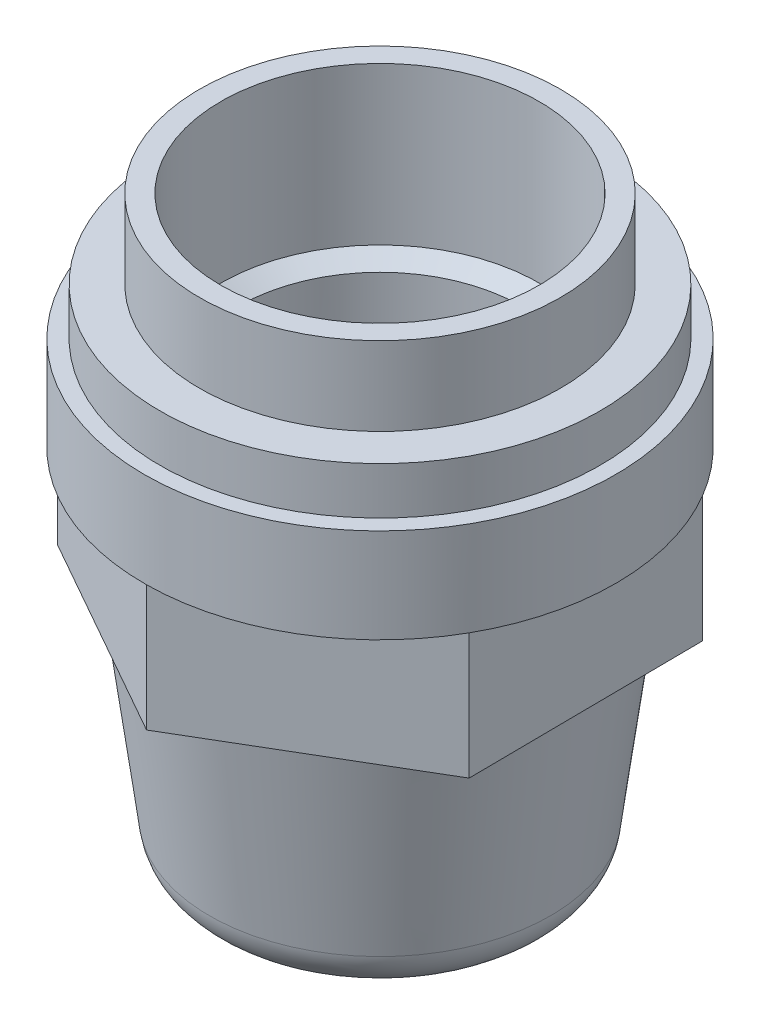
ISO-10303-21;
HEADER;
FILE_DESCRIPTION(('STEP AP214'),'2;1');
FILE_NAME('part.step','',(''),(''),'','','');
FILE_SCHEMA(('AUTOMOTIVE_DESIGN { 1 0 10303 214 1 1 1 1 }'));
ENDSEC;
DATA;
#1=APPLICATION_CONTEXT('core data for automotive mechanical design processes');
#2=APPLICATION_PROTOCOL_DEFINITION('international standard','automotive_design',2000,#1);
#3=PRODUCT_CONTEXT('',#1,'mechanical');
#4=PRODUCT('Part','Part','',(#3));
#5=PRODUCT_RELATED_PRODUCT_CATEGORY('part','',(#4));
#6=PRODUCT_DEFINITION_FORMATION('','',#4);
#7=PRODUCT_DEFINITION_CONTEXT('part definition',#1,'design');
#8=PRODUCT_DEFINITION('design','',#6,#7);
#9=PRODUCT_DEFINITION_SHAPE('','',#8);
#10=(LENGTH_UNIT() NAMED_UNIT(*) SI_UNIT(.MILLI.,.METRE.));
#11=(NAMED_UNIT(*) PLANE_ANGLE_UNIT() SI_UNIT($,.RADIAN.));
#12=(NAMED_UNIT(*) SI_UNIT($,.STERADIAN.) SOLID_ANGLE_UNIT());
#13=UNCERTAINTY_MEASURE_WITH_UNIT(LENGTH_MEASURE(1.E-05),#10,'distance_accuracy_value','');
#14=(GEOMETRIC_REPRESENTATION_CONTEXT(3) GLOBAL_UNCERTAINTY_ASSIGNED_CONTEXT((#13)) GLOBAL_UNIT_ASSIGNED_CONTEXT((#10,
#11,#12)) REPRESENTATION_CONTEXT('',''));
#15=CARTESIAN_POINT('',(0.,0.,0.));
#16=DIRECTION('',(0.,0.,1.));
#17=DIRECTION('',(1.,0.,0.));
#18=AXIS2_PLACEMENT_3D('',#15,#16,#17);
#19=CARTESIAN_POINT('',(0.,0.,0.));
#20=DIRECTION('',(0.,-1.,0.));
#21=DIRECTION('',(0.,0.,-1.));
#22=AXIS2_PLACEMENT_3D('',#19,#20,#21);
#23=CYLINDRICAL_SURFACE('',#22,8.97478397273857);
#24=CARTESIAN_POINT('',(0.,26.4239555504727,0.));
#25=DIRECTION('',(0.,1.,0.));
#26=DIRECTION('',(0.,0.,1.));
#27=AXIS2_PLACEMENT_3D('',#24,#25,#26);
#28=CIRCLE('',#27,8.97478397273857);
#29=CARTESIAN_POINT('',(0.,26.4239555504727,8.97478397273857));
#30=VERTEX_POINT('',#29);
#31=EDGE_CURVE('E43',#30,#30,#28,.T.);
#32=ORIENTED_EDGE('',*,*,#31,.T.);
#33=EDGE_LOOP('',(#32));
#34=FACE_BOUND('',#33,.T.);
#35=CARTESIAN_POINT('',(0.,23.1150750646285,0.));
#36=DIRECTION('',(0.,-1.,0.));
#37=DIRECTION('',(0.,0.,-1.));
#38=AXIS2_PLACEMENT_3D('',#35,#36,#37);
#39=CIRCLE('',#38,8.97478397273857);
#40=CARTESIAN_POINT('',(0.,23.1150750646285,-8.97478397273857));
#41=VERTEX_POINT('',#40);
#42=EDGE_CURVE('E159',#41,#41,#39,.T.);
#43=ORIENTED_EDGE('',*,*,#42,.T.);
#44=EDGE_LOOP('',(#43));
#45=FACE_BOUND('',#44,.T.);
#46=ADVANCED_FACE('F39',(#34,#45),#23,.F.);
#47=CARTESIAN_POINT('',(-12.4716213756877,23.1150750646285,0.));
#48=DIRECTION('',(0.,1.,0.));
#49=DIRECTION('',(0.,0.,1.));
#50=AXIS2_PLACEMENT_3D('',#47,#48,#49);
#51=PLANE('',#50);
#52=DIRECTION('',(0.00909857298194774,0.,0.999958607128161));
#53=VECTOR('',#52,1.);
#54=CARTESIAN_POINT('',(12.9085824864457,23.1150750646285,-7.61020666920113));
#55=LINE('',#54,#53);
#56=CARTESIAN_POINT('',(12.9085824864457,23.1150750646285,-7.61020666920113));
#57=VERTEX_POINT('',#56);
#58=CARTESIAN_POINT('',(13.0449235468008,23.1150750646285,7.37405702550828));
#59=VERTEX_POINT('',#58);
#60=EDGE_CURVE('E123',#57,#59,#55,.T.);
#61=ORIENTED_EDGE('',*,*,#60,.F.);
#62=CARTESIAN_POINT('',(0.,23.1150750646285,0.));
#63=DIRECTION('',(0.,-1.,0.));
#64=DIRECTION('',(0.,0.,-1.));
#65=AXIS2_PLACEMENT_3D('',#62,#63,#64);
#66=CIRCLE('',#65,14.9848839620908);
#67=EDGE_CURVE('E184',#57,#59,#66,.T.);
#68=ORIENTED_EDGE('',*,*,#67,.T.);
#69=EDGE_LOOP('',(#61,#68));
#70=FACE_BOUND('',#69,.T.);
#71=ADVANCED_FACE('F289',(#70),#51,.F.);
#72=DIRECTION('',(-0.861440270014917,0.,0.507858898904634));
#73=VECTOR('',#72,1.);
#74=CARTESIAN_POINT('',(13.0449235468008,23.1150750646285,7.37405702550828));
#75=LINE('',#74,#73);
#76=CARTESIAN_POINT('',(0.136341060355105,23.1150750646285,14.9842636947094));
#77=VERTEX_POINT('',#76);
#78=EDGE_CURVE('E217',#59,#77,#75,.T.);
#79=ORIENTED_EDGE('',*,*,#78,.F.);
#80=EDGE_CURVE('E189',#59,#77,#66,.T.);
#81=ORIENTED_EDGE('',*,*,#80,.T.);
#82=EDGE_LOOP('',(#79,#81));
#83=FACE_BOUND('',#82,.T.);
#84=ADVANCED_FACE('F281',(#83),#51,.F.);
#85=DIRECTION('',(-0.870538842996865,0.,-0.492099708223527));
#86=VECTOR('',#85,1.);
#87=CARTESIAN_POINT('',(0.136341060355095,23.1150750646285,14.9842636947094));
#88=LINE('',#87,#86);
#89=CARTESIAN_POINT('',(-12.9085824864457,23.1150750646285,7.61020666920113));
#90=VERTEX_POINT('',#89);
#91=EDGE_CURVE('E237',#77,#90,#88,.T.);
#92=ORIENTED_EDGE('',*,*,#91,.F.);
#93=EDGE_CURVE('E271',#77,#90,#66,.T.);
#94=ORIENTED_EDGE('',*,*,#93,.T.);
#95=EDGE_LOOP('',(#92,#94));
#96=FACE_BOUND('',#95,.T.);
#97=ADVANCED_FACE('F270',(#96),#51,.F.);
#98=DIRECTION('',(-0.00909857298194774,0.,-0.999958607128161));
#99=VECTOR('',#98,1.);
#100=CARTESIAN_POINT('',(-12.9085824864457,23.1150750646285,7.61020666920113));
#101=LINE('',#100,#99);
#102=CARTESIAN_POINT('',(-13.0449235468008,23.1150750646285,-7.37405702550826));
#103=VERTEX_POINT('',#102);
#104=EDGE_CURVE('E241',#90,#103,#101,.T.);
#105=ORIENTED_EDGE('',*,*,#104,.F.);
#106=EDGE_CURVE('E278',#90,#103,#66,.T.);
#107=ORIENTED_EDGE('',*,*,#106,.T.);
#108=EDGE_LOOP('',(#105,#107));
#109=FACE_BOUND('',#108,.T.);
#110=ADVANCED_FACE('F507',(#109),#51,.F.);
#111=DIRECTION('',(0.861440270014917,0.,-0.507858898904634));
#112=VECTOR('',#111,1.);
#113=CARTESIAN_POINT('',(-13.0449235468008,23.1150750646285,-7.37405702550827));
#114=LINE('',#113,#112);
#115=CARTESIAN_POINT('',(-0.13634106035509,23.1150750646285,-14.9842636947094));
#116=VERTEX_POINT('',#115);
#117=EDGE_CURVE('E62',#103,#116,#114,.T.);
#118=ORIENTED_EDGE('',*,*,#117,.F.);
#119=EDGE_CURVE('E285',#103,#116,#66,.T.);
#120=ORIENTED_EDGE('',*,*,#119,.T.);
#121=EDGE_LOOP('',(#118,#120));
#122=FACE_BOUND('',#121,.T.);
#123=ADVANCED_FACE('F349',(#122),#51,.F.);
#124=DIRECTION('',(0.870538842996865,0.,0.492099708223527));
#125=VECTOR('',#124,1.);
#126=CARTESIAN_POINT('',(-0.136341060355103,23.1150750646285,-14.9842636947094));
#127=LINE('',#126,#125);
#128=EDGE_CURVE('E55',#116,#57,#127,.T.);
#129=ORIENTED_EDGE('',*,*,#128,.F.);
#130=EDGE_CURVE('E183',#116,#57,#66,.T.);
#131=ORIENTED_EDGE('',*,*,#130,.T.);
#132=EDGE_LOOP('',(#129,#131));
#133=FACE_BOUND('',#132,.T.);
#134=ADVANCED_FACE('F287',(#133),#51,.F.);
#135=CARTESIAN_POINT('',(0.,0.130191102537697,0.));
#136=DIRECTION('',(0.,-1.,0.));
#137=DIRECTION('',(0.,0.,-1.));
#138=AXIS2_PLACEMENT_3D('',#135,#136,#137);
#139=CONICAL_SURFACE('',#138,4.5,0.00281604693828828);
#140=CARTESIAN_POINT('',(0.,2.48056138832506,0.));
#141=DIRECTION('',(0.,-1.,0.));
#142=DIRECTION('',(0.,0.,-1.));
#143=AXIS2_PLACEMENT_3D('',#140,#141,#142);
#144=CIRCLE('',#143,4.49338122945697);
#145=CARTESIAN_POINT('',(0.,2.48056138832506,-4.49338122945697));
#146=VERTEX_POINT('',#145);
#147=EDGE_CURVE('E125',#146,#146,#144,.T.);
#148=ORIENTED_EDGE('',*,*,#147,.F.);
#149=EDGE_LOOP('',(#148));
#150=FACE_BOUND('',#149,.T.);
#151=CARTESIAN_POINT('',(0.,0.130191102537697,0.));
#152=DIRECTION('',(0.,-1.,0.));
#153=DIRECTION('',(0.,0.,-1.));
#154=AXIS2_PLACEMENT_3D('',#151,#152,#153);
#155=CIRCLE('',#154,4.5);
#156=CARTESIAN_POINT('',(0.,0.130191102537697,-4.5));
#157=VERTEX_POINT('',#156);
#158=EDGE_CURVE('E11',#157,#157,#155,.T.);
#159=ORIENTED_EDGE('',*,*,#158,.T.);
#160=EDGE_LOOP('',(#159));
#161=FACE_BOUND('',#160,.T.);
#162=ADVANCED_FACE('F41',(#150,#161),#139,.F.);
#163=CARTESIAN_POINT('',(-4.5,0.130191102537697,0.));
#164=DIRECTION('',(0.,1.,0.));
#165=DIRECTION('',(0.,0.,1.));
#166=AXIS2_PLACEMENT_3D('',#163,#164,#165);
#167=PLANE('',#166);
#168=ORIENTED_EDGE('',*,*,#158,.F.);
#169=EDGE_LOOP('',(#168));
#170=FACE_BOUND('',#169,.T.);
#171=CARTESIAN_POINT('',(0.,0.130191102537697,0.));
#172=DIRECTION('',(0.,-1.,0.));
#173=DIRECTION('',(0.,0.,-1.));
#174=AXIS2_PLACEMENT_3D('',#171,#172,#173);
#175=CIRCLE('',#174,7.86886589131418);
#176=CARTESIAN_POINT('',(0.,0.130191102537697,-7.86886589131418));
#177=VERTEX_POINT('',#176);
#178=EDGE_CURVE('E49',#177,#177,#175,.T.);
#179=ORIENTED_EDGE('',*,*,#178,.T.);
#180=EDGE_LOOP('',(#179));
#181=FACE_BOUND('',#180,.T.);
#182=ADVANCED_FACE('F197',(#170,#181),#167,.F.);
#183=CARTESIAN_POINT('',(0.,3.1301911025377,0.));
#184=DIRECTION('',(0.,-1.,0.));
#185=DIRECTION('',(0.,0.,-1.));
#186=AXIS2_PLACEMENT_3D('',#183,#184,#185);
#187=TOROIDAL_SURFACE('',#186,7.8688658913142,3.);
#188=ORIENTED_EDGE('',*,*,#178,.F.);
#189=EDGE_LOOP('',(#188));
#190=FACE_BOUND('',#189,.T.);
#191=CARTESIAN_POINT('',(0.,2.73884198026211,0.));
#192=DIRECTION('',(0.,-1.,0.));
#193=DIRECTION('',(0.,0.,-1.));
#194=AXIS2_PLACEMENT_3D('',#191,#192,#193);
#195=CIRCLE('',#194,10.8432306746745);
#196=CARTESIAN_POINT('',(0.,2.73884198026211,-10.8432306746745));
#197=VERTEX_POINT('',#196);
#198=EDGE_CURVE('E188',#197,#197,#195,.T.);
#199=ORIENTED_EDGE('',*,*,#198,.T.);
#200=EDGE_LOOP('',(#199));
#201=FACE_BOUND('',#200,.T.);
#202=ADVANCED_FACE('F199',(#190,#201),#187,.T.);
#203=CARTESIAN_POINT('',(0.,15.1150750646285,0.));
#204=DIRECTION('',(0.,1.,0.));
#205=DIRECTION('',(0.,0.,1.));
#206=AXIS2_PLACEMENT_3D('',#203,#204,#205);
#207=CONICAL_SURFACE('',#206,12.4716213756877,0.130822549512117);
#208=ORIENTED_EDGE('',*,*,#198,.F.);
#209=EDGE_LOOP('',(#208));
#210=FACE_BOUND('',#209,.T.);
#211=CARTESIAN_POINT('',(0.,15.1150750646285,0.));
#212=DIRECTION('',(0.,-1.,0.));
#213=DIRECTION('',(0.,0.,-1.));
#214=AXIS2_PLACEMENT_3D('',#211,#212,#213);
#215=CIRCLE('',#214,12.4716213756877);
#216=CARTESIAN_POINT('',(0.,15.1150750646285,-12.4716213756877));
#217=VERTEX_POINT('',#216);
#218=EDGE_CURVE('E212',#217,#217,#215,.T.);
#219=ORIENTED_EDGE('',*,*,#218,.T.);
#220=EDGE_LOOP('',(#219));
#221=FACE_BOUND('',#220,.T.);
#222=ADVANCED_FACE('F202',(#210,#221),#207,.T.);
#223=CARTESIAN_POINT('',(0.,0.,0.));
#224=DIRECTION('',(0.,-1.,0.));
#225=DIRECTION('',(0.,0.,-1.));
#226=AXIS2_PLACEMENT_3D('',#223,#224,#225);
#227=CYLINDRICAL_SURFACE('',#226,14.9848839620908);
#228=ORIENTED_EDGE('',*,*,#67,.F.);
#229=ORIENTED_EDGE('',*,*,#130,.F.);
#230=ORIENTED_EDGE('',*,*,#119,.F.);
#231=ORIENTED_EDGE('',*,*,#106,.F.);
#232=ORIENTED_EDGE('',*,*,#93,.F.);
#233=ORIENTED_EDGE('',*,*,#80,.F.);
#234=EDGE_LOOP('',(#228,#229,#230,#231,#232,#233));
#235=FACE_BOUND('',#234,.T.);
#236=CARTESIAN_POINT('',(0.,29.1150750646285,0.));
#237=DIRECTION('',(0.,-1.,0.));
#238=DIRECTION('',(0.,0.,-1.));
#239=AXIS2_PLACEMENT_3D('',#236,#237,#238);
#240=CIRCLE('',#239,14.9848839620908);
#241=CARTESIAN_POINT('',(0.,29.1150750646285,-14.9848839620908));
#242=VERTEX_POINT('',#241);
#243=EDGE_CURVE('E179',#242,#242,#240,.T.);
#244=ORIENTED_EDGE('',*,*,#243,.T.);
#245=EDGE_LOOP('',(#244));
#246=FACE_BOUND('',#245,.T.);
#247=ADVANCED_FACE('F208',(#235,#246),#227,.T.);
#248=CARTESIAN_POINT('',(-14.9848839620908,29.1150750646285,0.));
#249=DIRECTION('',(0.,-1.,0.));
#250=DIRECTION('',(0.,0.,-1.));
#251=AXIS2_PLACEMENT_3D('',#248,#249,#250);
#252=PLANE('',#251);
#253=ORIENTED_EDGE('',*,*,#243,.F.);
#254=EDGE_LOOP('',(#253));
#255=FACE_BOUND('',#254,.T.);
#256=CARTESIAN_POINT('',(0.,29.1150750646285,0.));
#257=DIRECTION('',(0.,-1.,0.));
#258=DIRECTION('',(0.,0.,-1.));
#259=AXIS2_PLACEMENT_3D('',#256,#257,#258);
#260=CIRCLE('',#259,13.9838030362747);
#261=CARTESIAN_POINT('',(0.,29.1150750646285,-13.9838030362747));
#262=VERTEX_POINT('',#261);
#263=EDGE_CURVE('E175',#262,#262,#260,.T.);
#264=ORIENTED_EDGE('',*,*,#263,.T.);
#265=EDGE_LOOP('',(#264));
#266=FACE_BOUND('',#265,.T.);
#267=ADVANCED_FACE('F332',(#255,#266),#252,.F.);
#268=CARTESIAN_POINT('',(0.,0.,0.));
#269=DIRECTION('',(0.,-1.,0.));
#270=DIRECTION('',(0.,0.,-1.));
#271=AXIS2_PLACEMENT_3D('',#268,#269,#270);
#272=CYLINDRICAL_SURFACE('',#271,13.9838030362747);
#273=ORIENTED_EDGE('',*,*,#263,.F.);
#274=EDGE_LOOP('',(#273));
#275=FACE_BOUND('',#274,.T.);
#276=CARTESIAN_POINT('',(0.,32.1150750646285,0.));
#277=DIRECTION('',(0.,-1.,0.));
#278=DIRECTION('',(0.,0.,-1.));
#279=AXIS2_PLACEMENT_3D('',#276,#277,#278);
#280=CIRCLE('',#279,13.9838030362747);
#281=CARTESIAN_POINT('',(0.,32.1150750646285,-13.9838030362747));
#282=VERTEX_POINT('',#281);
#283=EDGE_CURVE('E171',#282,#282,#280,.T.);
#284=ORIENTED_EDGE('',*,*,#283,.T.);
#285=EDGE_LOOP('',(#284));
#286=FACE_BOUND('',#285,.T.);
#287=ADVANCED_FACE('F328',(#275,#286),#272,.T.);
#288=CARTESIAN_POINT('',(-13.9838030362747,32.1150750646285,0.));
#289=DIRECTION('',(0.,-1.,0.));
#290=DIRECTION('',(0.,0.,-1.));
#291=AXIS2_PLACEMENT_3D('',#288,#289,#290);
#292=PLANE('',#291);
#293=ORIENTED_EDGE('',*,*,#283,.F.);
#294=EDGE_LOOP('',(#293));
#295=FACE_BOUND('',#294,.T.);
#296=CARTESIAN_POINT('',(0.,32.1150750646285,0.));
#297=DIRECTION('',(0.,-1.,0.));
#298=DIRECTION('',(0.,0.,-1.));
#299=AXIS2_PLACEMENT_3D('',#296,#297,#298);
#300=CIRCLE('',#299,11.4802764495166);
#301=CARTESIAN_POINT('',(0.,32.1150750646285,-11.4802764495166));
#302=VERTEX_POINT('',#301);
#303=EDGE_CURVE('E167',#302,#302,#300,.T.);
#304=ORIENTED_EDGE('',*,*,#303,.T.);
#305=EDGE_LOOP('',(#304));
#306=FACE_BOUND('',#305,.T.);
#307=ADVANCED_FACE('F324',(#295,#306),#292,.F.);
#308=CARTESIAN_POINT('',(0.,0.,0.));
#309=DIRECTION('',(0.,-1.,0.));
#310=DIRECTION('',(0.,0.,-1.));
#311=AXIS2_PLACEMENT_3D('',#308,#309,#310);
#312=CYLINDRICAL_SURFACE('',#311,11.4802764495166);
#313=ORIENTED_EDGE('',*,*,#303,.F.);
#314=EDGE_LOOP('',(#313));
#315=FACE_BOUND('',#314,.T.);
#316=CARTESIAN_POINT('',(0.,37.1150750646285,0.));
#317=DIRECTION('',(0.,-1.,0.));
#318=DIRECTION('',(0.,0.,-1.));
#319=AXIS2_PLACEMENT_3D('',#316,#317,#318);
#320=CIRCLE('',#319,11.4802764495166);
#321=CARTESIAN_POINT('',(0.,37.1150750646285,-11.4802764495166));
#322=VERTEX_POINT('',#321);
#323=EDGE_CURVE('E163',#322,#322,#320,.T.);
#324=ORIENTED_EDGE('',*,*,#323,.T.);
#325=EDGE_LOOP('',(#324));
#326=FACE_BOUND('',#325,.T.);
#327=ADVANCED_FACE('F320',(#315,#326),#312,.T.);
#328=CARTESIAN_POINT('',(-11.4802764495166,37.1150750646285,0.));
#329=DIRECTION('',(0.,-1.,0.));
#330=DIRECTION('',(0.,0.,-1.));
#331=AXIS2_PLACEMENT_3D('',#328,#329,#330);
#332=PLANE('',#331);
#333=CARTESIAN_POINT('',(0.,37.1150750646285,0.));
#334=DIRECTION('',(0.,1.,0.));
#335=DIRECTION('',(0.,0.,1.));
#336=AXIS2_PLACEMENT_3D('',#333,#334,#335);
#337=CIRCLE('',#336,10.125);
#338=CARTESIAN_POINT('',(0.,37.1150750646285,10.125));
#339=VERTEX_POINT('',#338);
#340=EDGE_CURVE('E594',#339,#339,#337,.T.);
#341=ORIENTED_EDGE('',*,*,#340,.F.);
#342=EDGE_LOOP('',(#341));
#343=FACE_BOUND('',#342,.T.);
#344=ORIENTED_EDGE('',*,*,#323,.F.);
#345=EDGE_LOOP('',(#344));
#346=FACE_BOUND('',#345,.T.);
#347=ADVANCED_FACE('F317',(#343,#346),#332,.F.);
#348=CARTESIAN_POINT('',(-8.97478397273857,23.1150750646285,0.));
#349=DIRECTION('',(0.,-1.,0.));
#350=DIRECTION('',(0.,0.,-1.));
#351=AXIS2_PLACEMENT_3D('',#348,#349,#350);
#352=PLANE('',#351);
#353=ORIENTED_EDGE('',*,*,#42,.F.);
#354=EDGE_LOOP('',(#353));
#355=FACE_BOUND('',#354,.T.);
#356=CARTESIAN_POINT('',(0.,23.1150750646285,0.));
#357=DIRECTION('',(0.,-1.,0.));
#358=DIRECTION('',(0.,0.,-1.));
#359=AXIS2_PLACEMENT_3D('',#356,#357,#358);
#360=CIRCLE('',#359,6.97478397273856);
#361=CARTESIAN_POINT('',(0.,23.1150750646285,-6.97478397273856));
#362=VERTEX_POINT('',#361);
#363=EDGE_CURVE('E155',#362,#362,#360,.T.);
#364=ORIENTED_EDGE('',*,*,#363,.T.);
#365=EDGE_LOOP('',(#364));
#366=FACE_BOUND('',#365,.T.);
#367=ADVANCED_FACE('F315',(#355,#366),#352,.F.);
#368=CARTESIAN_POINT('',(0.,0.,0.));
#369=DIRECTION('',(0.,-1.,0.));
#370=DIRECTION('',(0.,0.,-1.));
#371=AXIS2_PLACEMENT_3D('',#368,#369,#370);
#372=CYLINDRICAL_SURFACE('',#371,6.97478397273856);
#373=ORIENTED_EDGE('',*,*,#363,.F.);
#374=EDGE_LOOP('',(#373));
#375=FACE_BOUND('',#374,.T.);
#376=CARTESIAN_POINT('',(0.,18.1150750646285,0.));
#377=DIRECTION('',(0.,-1.,0.));
#378=DIRECTION('',(0.,0.,-1.));
#379=AXIS2_PLACEMENT_3D('',#376,#377,#378);
#380=CIRCLE('',#379,6.97478397273856);
#381=CARTESIAN_POINT('',(0.,18.1150750646285,-6.97478397273856));
#382=VERTEX_POINT('',#381);
#383=EDGE_CURVE('E151',#382,#382,#380,.T.);
#384=ORIENTED_EDGE('',*,*,#383,.T.);
#385=EDGE_LOOP('',(#384));
#386=FACE_BOUND('',#385,.T.);
#387=ADVANCED_FACE('F378',(#375,#386),#372,.F.);
#388=CARTESIAN_POINT('',(-6.97478397273856,18.1150750646285,0.));
#389=DIRECTION('',(0.,-1.,0.));
#390=DIRECTION('',(0.,0.,-1.));
#391=AXIS2_PLACEMENT_3D('',#388,#389,#390);
#392=PLANE('',#391);
#393=ORIENTED_EDGE('',*,*,#383,.F.);
#394=EDGE_LOOP('',(#393));
#395=FACE_BOUND('',#394,.T.);
#396=CARTESIAN_POINT('',(0.,18.1150750646285,0.));
#397=DIRECTION('',(0.,-1.,0.));
#398=DIRECTION('',(0.,0.,-1.));
#399=AXIS2_PLACEMENT_3D('',#396,#397,#398);
#400=CIRCLE('',#399,4.44935358870533);
#401=CARTESIAN_POINT('',(0.,18.1150750646285,-4.44935358870533));
#402=VERTEX_POINT('',#401);
#403=EDGE_CURVE('E147',#402,#402,#400,.T.);
#404=ORIENTED_EDGE('',*,*,#403,.T.);
#405=EDGE_LOOP('',(#404));
#406=FACE_BOUND('',#405,.T.);
#407=ADVANCED_FACE('F375',(#395,#406),#392,.F.);
#408=CARTESIAN_POINT('',(0.,3.47985752684565,0.));
#409=DIRECTION('',(0.,-1.,0.));
#410=DIRECTION('',(0.,0.,-1.));
#411=AXIS2_PLACEMENT_3D('',#408,#409,#410);
#412=CONICAL_SURFACE('',#411,4.49056715718698,0.00281604693830745);
#413=ORIENTED_EDGE('',*,*,#403,.F.);
#414=EDGE_LOOP('',(#413));
#415=FACE_BOUND('',#414,.T.);
#416=CARTESIAN_POINT('',(0.,3.47985752684565,0.));
#417=DIRECTION('',(0.,-1.,0.));
#418=DIRECTION('',(0.,0.,-1.));
#419=AXIS2_PLACEMENT_3D('',#416,#417,#418);
#420=CIRCLE('',#419,4.49056715718698);
#421=CARTESIAN_POINT('',(0.,3.47985752684565,-4.49056715718698));
#422=VERTEX_POINT('',#421);
#423=EDGE_CURVE('E143',#422,#422,#420,.T.);
#424=ORIENTED_EDGE('',*,*,#423,.T.);
#425=EDGE_LOOP('',(#424));
#426=FACE_BOUND('',#425,.T.);
#427=ADVANCED_FACE('F371',(#415,#426),#412,.F.);
#428=CARTESIAN_POINT('',(0.,3.48921192697943,0.));
#429=DIRECTION('',(0.,1.,0.));
#430=DIRECTION('',(0.,0.,1.));
#431=AXIS2_PLACEMENT_3D('',#428,#429,#430);
#432=CONICAL_SURFACE('',#431,6.48806240818296,1.56611329601126);
#433=ORIENTED_EDGE('',*,*,#423,.F.);
#434=EDGE_LOOP('',(#433));
#435=FACE_BOUND('',#434,.T.);
#436=CARTESIAN_POINT('',(0.,3.48921192697943,0.));
#437=DIRECTION('',(0.,-1.,0.));
#438=DIRECTION('',(0.,0.,-1.));
#439=AXIS2_PLACEMENT_3D('',#436,#437,#438);
#440=CIRCLE('',#439,6.48806240818296);
#441=CARTESIAN_POINT('',(0.,3.48921192697943,-6.48806240818296));
#442=VERTEX_POINT('',#441);
#443=EDGE_CURVE('E139',#442,#442,#440,.T.);
#444=ORIENTED_EDGE('',*,*,#443,.T.);
#445=EDGE_LOOP('',(#444));
#446=FACE_BOUND('',#445,.T.);
#447=ADVANCED_FACE('F362',(#435,#446),#432,.T.);
#448=CARTESIAN_POINT('',(0.,2.48991578845883,0.));
#449=DIRECTION('',(0.,-1.,0.));
#450=DIRECTION('',(0.,0.,-1.));
#451=AXIS2_PLACEMENT_3D('',#448,#449,#450);
#452=CONICAL_SURFACE('',#451,6.49087648045295,0.00281604693830598);
#453=ORIENTED_EDGE('',*,*,#443,.F.);
#454=EDGE_LOOP('',(#453));
#455=FACE_BOUND('',#454,.T.);
#456=CARTESIAN_POINT('',(0.,2.48991578845883,0.));
#457=DIRECTION('',(0.,-1.,0.));
#458=DIRECTION('',(0.,0.,-1.));
#459=AXIS2_PLACEMENT_3D('',#456,#457,#458);
#460=CIRCLE('',#459,6.49087648045295);
#461=CARTESIAN_POINT('',(0.,2.48991578845883,-6.49087648045295));
#462=VERTEX_POINT('',#461);
#463=EDGE_CURVE('E130',#462,#462,#460,.T.);
#464=ORIENTED_EDGE('',*,*,#463,.T.);
#465=EDGE_LOOP('',(#464));
#466=FACE_BOUND('',#465,.T.);
#467=ADVANCED_FACE('F354',(#455,#466),#452,.F.);
#468=CARTESIAN_POINT('',(0.,2.48056138832506,0.));
#469=DIRECTION('',(0.,1.,0.));
#470=DIRECTION('',(0.,0.,1.));
#471=AXIS2_PLACEMENT_3D('',#468,#469,#470);
#472=CONICAL_SURFACE('',#471,4.49338122945697,1.56611329601126);
#473=ORIENTED_EDGE('',*,*,#463,.F.);
#474=EDGE_LOOP('',(#473));
#475=FACE_BOUND('',#474,.T.);
#476=ORIENTED_EDGE('',*,*,#147,.T.);
#477=EDGE_LOOP('',(#476));
#478=FACE_BOUND('',#477,.T.);
#479=ADVANCED_FACE('F352',(#475,#478),#472,.F.);
#480=CARTESIAN_POINT('',(0.,15.1150750646285,0.));
#481=DIRECTION('',(0.,-1.,0.));
#482=DIRECTION('',(0.,0.,-1.));
#483=AXIS2_PLACEMENT_3D('',#480,#481,#482);
#484=PLANE('',#483);
#485=DIRECTION('',(0.00909857298194774,0.,0.999958607128161));
#486=VECTOR('',#485,1.);
#487=CARTESIAN_POINT('',(12.9085824864457,15.1150750646285,-7.61020666920113));
#488=LINE('',#487,#486);
#489=CARTESIAN_POINT('',(12.9085824864457,15.1150750646285,-7.61020666920113));
#490=VERTEX_POINT('',#489);
#491=CARTESIAN_POINT('',(13.0449235468008,15.1150750646285,7.37405702550828));
#492=VERTEX_POINT('',#491);
#493=EDGE_CURVE('E109',#490,#492,#488,.T.);
#494=ORIENTED_EDGE('',*,*,#493,.T.);
#495=DIRECTION('',(-0.861440270014917,0.,0.507858898904634));
#496=VECTOR('',#495,1.);
#497=CARTESIAN_POINT('',(13.0449235468008,15.1150750646285,7.37405702550828));
#498=LINE('',#497,#496);
#499=CARTESIAN_POINT('',(0.136341060355095,15.1150750646285,14.9842636947094));
#500=VERTEX_POINT('',#499);
#501=EDGE_CURVE('E96',#492,#500,#498,.T.);
#502=ORIENTED_EDGE('',*,*,#501,.T.);
#503=DIRECTION('',(-0.870538842996865,0.,-0.492099708223527));
#504=VECTOR('',#503,1.);
#505=CARTESIAN_POINT('',(0.136341060355095,15.1150750646285,14.9842636947094));
#506=LINE('',#505,#504);
#507=CARTESIAN_POINT('',(-12.9085824864457,15.1150750646285,7.61020666920113));
#508=VERTEX_POINT('',#507);
#509=EDGE_CURVE('E108',#500,#508,#506,.T.);
#510=ORIENTED_EDGE('',*,*,#509,.T.);
#511=DIRECTION('',(-0.00909857298194774,0.,-0.999958607128161));
#512=VECTOR('',#511,1.);
#513=CARTESIAN_POINT('',(-12.9085824864457,15.1150750646285,7.61020666920113));
#514=LINE('',#513,#512);
#515=CARTESIAN_POINT('',(-13.0449235468008,15.1150750646285,-7.37405702550827));
#516=VERTEX_POINT('',#515);
#517=EDGE_CURVE('E226',#508,#516,#514,.T.);
#518=ORIENTED_EDGE('',*,*,#517,.T.);
#519=DIRECTION('',(0.861440270014917,0.,-0.507858898904634));
#520=VECTOR('',#519,1.);
#521=CARTESIAN_POINT('',(-13.0449235468008,15.1150750646285,-7.37405702550827));
#522=LINE('',#521,#520);
#523=CARTESIAN_POINT('',(-0.136341060355103,15.1150750646285,-14.9842636947094));
#524=VERTEX_POINT('',#523);
#525=EDGE_CURVE('E229',#516,#524,#522,.T.);
#526=ORIENTED_EDGE('',*,*,#525,.T.);
#527=DIRECTION('',(0.870538842996865,0.,0.492099708223527));
#528=VECTOR('',#527,1.);
#529=CARTESIAN_POINT('',(-0.136341060355103,15.1150750646285,-14.9842636947094));
#530=LINE('',#529,#528);
#531=EDGE_CURVE('E115',#524,#490,#530,.T.);
#532=ORIENTED_EDGE('',*,*,#531,.T.);
#533=EDGE_LOOP('',(#494,#502,#510,#518,#526,#532));
#534=FACE_BOUND('',#533,.T.);
#535=ORIENTED_EDGE('',*,*,#218,.F.);
#536=EDGE_LOOP('',(#535));
#537=FACE_BOUND('',#536,.T.);
#538=ADVANCED_FACE('F112',(#534,#537),#484,.T.);
#539=CARTESIAN_POINT('',(12.9085824864457,15.1150750646285,-7.61020666920113));
#540=DIRECTION('',(-0.999958607128161,0.,0.00909857298194774));
#541=DIRECTION('',(0.00909857298194774,0.,0.999958607128161));
#542=AXIS2_PLACEMENT_3D('',#539,#540,#541);
#543=PLANE('',#542);
#544=ORIENTED_EDGE('',*,*,#60,.T.);
#545=DIRECTION('',(0.,1.,0.));
#546=VECTOR('',#545,1.);
#547=CARTESIAN_POINT('',(13.0449235468008,15.1150750646285,7.37405702550828));
#548=LINE('',#547,#546);
#549=EDGE_CURVE('E101',#492,#59,#548,.T.);
#550=ORIENTED_EDGE('',*,*,#549,.F.);
#551=ORIENTED_EDGE('',*,*,#493,.F.);
#552=DIRECTION('',(0.,1.,0.));
#553=VECTOR('',#552,1.);
#554=CARTESIAN_POINT('',(12.9085824864457,15.1150750646285,-7.61020666920113));
#555=LINE('',#554,#553);
#556=EDGE_CURVE('E233',#490,#57,#555,.T.);
#557=ORIENTED_EDGE('',*,*,#556,.T.);
#558=EDGE_LOOP('',(#544,#550,#551,#557));
#559=FACE_BOUND('',#558,.T.);
#560=ADVANCED_FACE('F121',(#559),#543,.F.);
#561=CARTESIAN_POINT('',(13.0449235468008,15.1150750646285,7.37405702550828));
#562=DIRECTION('',(-0.507858898904634,0.,-0.861440270014917));
#563=DIRECTION('',(-0.861440270014917,0.,0.507858898904634));
#564=AXIS2_PLACEMENT_3D('',#561,#562,#563);
#565=PLANE('',#564);
#566=ORIENTED_EDGE('',*,*,#78,.T.);
#567=DIRECTION('',(0.,1.,0.));
#568=VECTOR('',#567,1.);
#569=CARTESIAN_POINT('',(0.136341060355095,15.1150750646285,14.9842636947094));
#570=LINE('',#569,#568);
#571=EDGE_CURVE('E104',#500,#77,#570,.T.);
#572=ORIENTED_EDGE('',*,*,#571,.F.);
#573=ORIENTED_EDGE('',*,*,#501,.F.);
#574=ORIENTED_EDGE('',*,*,#549,.T.);
#575=EDGE_LOOP('',(#566,#572,#573,#574));
#576=FACE_BOUND('',#575,.T.);
#577=ADVANCED_FACE('F99',(#576),#565,.F.);
#578=CARTESIAN_POINT('',(0.136341060355095,15.1150750646285,14.9842636947094));
#579=DIRECTION('',(0.492099708223527,0.,-0.870538842996865));
#580=DIRECTION('',(-0.870538842996865,0.,-0.492099708223527));
#581=AXIS2_PLACEMENT_3D('',#578,#579,#580);
#582=PLANE('',#581);
#583=ORIENTED_EDGE('',*,*,#91,.T.);
#584=DIRECTION('',(0.,1.,0.));
#585=VECTOR('',#584,1.);
#586=CARTESIAN_POINT('',(-12.9085824864457,15.1150750646285,7.61020666920113));
#587=LINE('',#586,#585);
#588=EDGE_CURVE('E132',#508,#90,#587,.T.);
#589=ORIENTED_EDGE('',*,*,#588,.F.);
#590=ORIENTED_EDGE('',*,*,#509,.F.);
#591=ORIENTED_EDGE('',*,*,#571,.T.);
#592=EDGE_LOOP('',(#583,#589,#590,#591));
#593=FACE_BOUND('',#592,.T.);
#594=ADVANCED_FACE('F266',(#593),#582,.F.);
#595=CARTESIAN_POINT('',(-12.9085824864457,15.1150750646285,7.61020666920113));
#596=DIRECTION('',(0.999958607128161,0.,-0.00909857298194774));
#597=DIRECTION('',(-0.00909857298194774,0.,-0.999958607128161));
#598=AXIS2_PLACEMENT_3D('',#595,#596,#597);
#599=PLANE('',#598);
#600=ORIENTED_EDGE('',*,*,#104,.T.);
#601=DIRECTION('',(0.,1.,0.));
#602=VECTOR('',#601,1.);
#603=CARTESIAN_POINT('',(-13.0449235468008,15.1150750646285,-7.37405702550827));
#604=LINE('',#603,#602);
#605=EDGE_CURVE('E255',#516,#103,#604,.T.);
#606=ORIENTED_EDGE('',*,*,#605,.F.);
#607=ORIENTED_EDGE('',*,*,#517,.F.);
#608=ORIENTED_EDGE('',*,*,#588,.T.);
#609=EDGE_LOOP('',(#600,#606,#607,#608));
#610=FACE_BOUND('',#609,.T.);
#611=ADVANCED_FACE('F263',(#610),#599,.F.);
#612=CARTESIAN_POINT('',(-13.0449235468008,15.1150750646285,-7.37405702550827));
#613=DIRECTION('',(0.507858898904634,0.,0.861440270014917));
#614=DIRECTION('',(0.861440270014917,0.,-0.507858898904634));
#615=AXIS2_PLACEMENT_3D('',#612,#613,#614);
#616=PLANE('',#615);
#617=ORIENTED_EDGE('',*,*,#117,.T.);
#618=DIRECTION('',(0.,1.,0.));
#619=VECTOR('',#618,1.);
#620=CARTESIAN_POINT('',(-0.136341060355103,15.1150750646285,-14.9842636947094));
#621=LINE('',#620,#619);
#622=EDGE_CURVE('E251',#524,#116,#621,.T.);
#623=ORIENTED_EDGE('',*,*,#622,.F.);
#624=ORIENTED_EDGE('',*,*,#525,.F.);
#625=ORIENTED_EDGE('',*,*,#605,.T.);
#626=EDGE_LOOP('',(#617,#623,#624,#625));
#627=FACE_BOUND('',#626,.T.);
#628=ADVANCED_FACE('F295',(#627),#616,.F.);
#629=CARTESIAN_POINT('',(-0.136341060355103,15.1150750646285,-14.9842636947094));
#630=DIRECTION('',(-0.492099708223527,0.,0.870538842996865));
#631=DIRECTION('',(0.870538842996865,0.,0.492099708223527));
#632=AXIS2_PLACEMENT_3D('',#629,#630,#631);
#633=PLANE('',#632);
#634=ORIENTED_EDGE('',*,*,#128,.T.);
#635=ORIENTED_EDGE('',*,*,#556,.F.);
#636=ORIENTED_EDGE('',*,*,#531,.F.);
#637=ORIENTED_EDGE('',*,*,#622,.T.);
#638=EDGE_LOOP('',(#634,#635,#636,#637));
#639=FACE_BOUND('',#638,.T.);
#640=ADVANCED_FACE('F291',(#639),#633,.F.);
#641=CARTESIAN_POINT('',(0.,27.1150750646285,0.));
#642=DIRECTION('',(0.,1.,0.));
#643=DIRECTION('',(0.,0.,1.));
#644=AXIS2_PLACEMENT_3D('',#641,#642,#643);
#645=CONICAL_SURFACE('',#644,10.125,1.02974425867665);
#646=CARTESIAN_POINT('',(0.,27.1150750646285,0.));
#647=DIRECTION('',(0.,1.,0.));
#648=DIRECTION('',(0.,0.,1.));
#649=AXIS2_PLACEMENT_3D('',#646,#647,#648);
#650=CIRCLE('',#649,10.125);
#651=CARTESIAN_POINT('',(0.,27.1150750646285,10.125));
#652=VERTEX_POINT('',#651);
#653=EDGE_CURVE('E220',#652,#652,#650,.T.);
#654=ORIENTED_EDGE('',*,*,#653,.T.);
#655=EDGE_LOOP('',(#654));
#656=FACE_BOUND('',#655,.T.);
#657=ORIENTED_EDGE('',*,*,#31,.F.);
#658=EDGE_LOOP('',(#657));
#659=FACE_BOUND('',#658,.T.);
#660=ADVANCED_FACE('F302',(#656,#659),#645,.F.);
#661=CARTESIAN_POINT('',(0.,37.1150750646285,0.));
#662=DIRECTION('',(0.,1.,0.));
#663=DIRECTION('',(0.,0.,1.));
#664=AXIS2_PLACEMENT_3D('',#661,#662,#663);
#665=CYLINDRICAL_SURFACE('',#664,10.125);
#666=ORIENTED_EDGE('',*,*,#653,.F.);
#667=EDGE_LOOP('',(#666));
#668=FACE_BOUND('',#667,.T.);
#669=ORIENTED_EDGE('',*,*,#340,.T.);
#670=EDGE_LOOP('',(#669));
#671=FACE_BOUND('',#670,.T.);
#672=ADVANCED_FACE('F575',(#668,#671),#665,.F.);
#673=CLOSED_SHELL('',(#46,#71,#84,#97,#110,#123,#134,#162,#182,#202,#222,#247,#267,#287,#307,
#327,#347,#367,#387,#407,#427,#447,#467,#479,#538,#560,#577,#594,#611,#628,#640,#660,#672));
#674=MANIFOLD_SOLID_BREP('B2',#673);
#675=ADVANCED_BREP_SHAPE_REPRESENTATION('',(#18,#674),#14);
#676=SHAPE_DEFINITION_REPRESENTATION(#9,#675);
ENDSEC;
END-ISO-10303-21;
